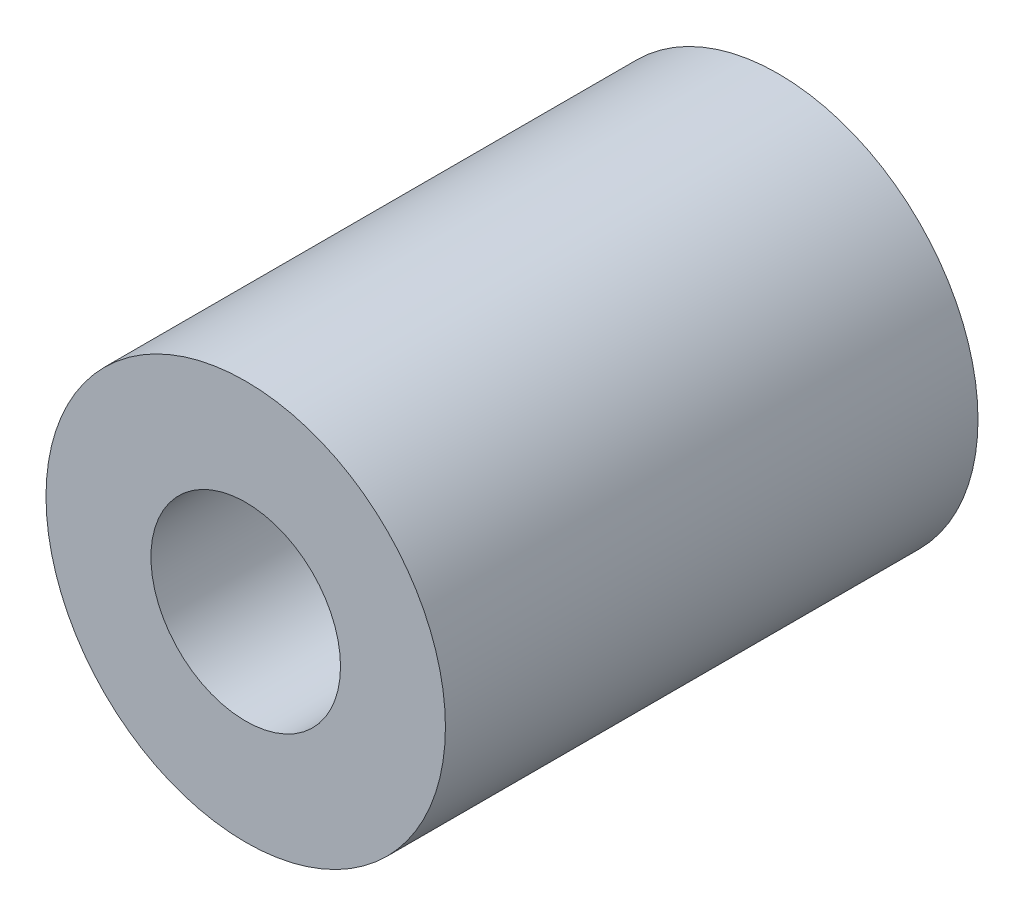
ISO-10303-21;
HEADER;
FILE_DESCRIPTION(('STEP AP214'),'2;1');
FILE_NAME('part.step','',(''),(''),'','','');
FILE_SCHEMA(('AUTOMOTIVE_DESIGN { 1 0 10303 214 1 1 1 1 }'));
ENDSEC;
DATA;
#1=APPLICATION_CONTEXT('core data for automotive mechanical design processes');
#2=APPLICATION_PROTOCOL_DEFINITION('international standard','automotive_design',2000,#1);
#3=PRODUCT_CONTEXT('',#1,'mechanical');
#4=PRODUCT('Part','Part','',(#3));
#5=PRODUCT_RELATED_PRODUCT_CATEGORY('part','',(#4));
#6=PRODUCT_DEFINITION_FORMATION('','',#4);
#7=PRODUCT_DEFINITION_CONTEXT('part definition',#1,'design');
#8=PRODUCT_DEFINITION('design','',#6,#7);
#9=PRODUCT_DEFINITION_SHAPE('','',#8);
#10=(LENGTH_UNIT() NAMED_UNIT(*) SI_UNIT(.MILLI.,.METRE.));
#11=(NAMED_UNIT(*) PLANE_ANGLE_UNIT() SI_UNIT($,.RADIAN.));
#12=(NAMED_UNIT(*) SI_UNIT($,.STERADIAN.) SOLID_ANGLE_UNIT());
#13=UNCERTAINTY_MEASURE_WITH_UNIT(LENGTH_MEASURE(1.E-05),#10,'distance_accuracy_value','');
#14=(GEOMETRIC_REPRESENTATION_CONTEXT(3) GLOBAL_UNCERTAINTY_ASSIGNED_CONTEXT((#13)) GLOBAL_UNIT_ASSIGNED_CONTEXT((#10,
#11,#12)) REPRESENTATION_CONTEXT('',''));
#15=CARTESIAN_POINT('',(0.,0.,0.));
#16=DIRECTION('',(0.,0.,1.));
#17=DIRECTION('',(1.,0.,0.));
#18=AXIS2_PLACEMENT_3D('',#15,#16,#17);
#19=CARTESIAN_POINT('',(0.,0.,6.35));
#20=DIRECTION('',(0.,0.,-1.));
#21=DIRECTION('',(-1.,0.,0.));
#22=AXIS2_PLACEMENT_3D('',#19,#20,#21);
#23=CYLINDRICAL_SURFACE('',#22,2.38125);
#24=CARTESIAN_POINT('',(0.,0.,6.35));
#25=DIRECTION('',(0.,0.,1.));
#26=DIRECTION('',(1.,0.,0.));
#27=AXIS2_PLACEMENT_3D('',#24,#25,#26);
#28=CIRCLE('',#27,2.38125);
#29=CARTESIAN_POINT('',(2.38125,0.,6.35));
#30=VERTEX_POINT('',#29);
#31=EDGE_CURVE('E10',#30,#30,#28,.T.);
#32=ORIENTED_EDGE('',*,*,#31,.F.);
#33=EDGE_LOOP('',(#32));
#34=FACE_BOUND('',#33,.T.);
#35=CARTESIAN_POINT('',(0.,0.,0.));
#36=DIRECTION('',(0.,0.,1.));
#37=DIRECTION('',(1.,0.,0.));
#38=AXIS2_PLACEMENT_3D('',#35,#36,#37);
#39=CIRCLE('',#38,2.38125);
#40=CARTESIAN_POINT('',(2.38125,0.,0.));
#41=VERTEX_POINT('',#40);
#42=EDGE_CURVE('E36',#41,#41,#39,.T.);
#43=ORIENTED_EDGE('',*,*,#42,.T.);
#44=EDGE_LOOP('',(#43));
#45=FACE_BOUND('',#44,.T.);
#46=ADVANCED_FACE('F33',(#34,#45),#23,.T.);
#47=CARTESIAN_POINT('',(0.,0.,6.35));
#48=DIRECTION('',(0.,0.,1.));
#49=DIRECTION('',(1.,0.,0.));
#50=AXIS2_PLACEMENT_3D('',#47,#48,#49);
#51=PLANE('',#50);
#52=CARTESIAN_POINT('',(0.,0.,6.35));
#53=DIRECTION('',(0.,0.,1.));
#54=DIRECTION('',(1.,0.,0.));
#55=AXIS2_PLACEMENT_3D('',#52,#53,#54);
#56=CIRCLE('',#55,1.13029999999999);
#57=CARTESIAN_POINT('',(1.13029999999999,0.,6.35));
#58=VERTEX_POINT('',#57);
#59=EDGE_CURVE('E47',#58,#58,#56,.T.);
#60=ORIENTED_EDGE('',*,*,#59,.F.);
#61=EDGE_LOOP('',(#60));
#62=FACE_BOUND('',#61,.T.);
#63=ORIENTED_EDGE('',*,*,#31,.T.);
#64=EDGE_LOOP('',(#63));
#65=FACE_BOUND('',#64,.T.);
#66=ADVANCED_FACE('F53',(#62,#65),#51,.T.);
#67=CARTESIAN_POINT('',(0.,0.,0.));
#68=DIRECTION('',(0.,0.,1.));
#69=DIRECTION('',(1.,0.,0.));
#70=AXIS2_PLACEMENT_3D('',#67,#68,#69);
#71=PLANE('',#70);
#72=CARTESIAN_POINT('',(0.,0.,0.));
#73=DIRECTION('',(0.,0.,1.));
#74=DIRECTION('',(1.,0.,0.));
#75=AXIS2_PLACEMENT_3D('',#72,#73,#74);
#76=CIRCLE('',#75,1.1303);
#77=CARTESIAN_POINT('',(1.1303,0.,0.));
#78=VERTEX_POINT('',#77);
#79=EDGE_CURVE('E43',#78,#78,#76,.T.);
#80=ORIENTED_EDGE('',*,*,#79,.T.);
#81=EDGE_LOOP('',(#80));
#82=FACE_BOUND('',#81,.T.);
#83=ORIENTED_EDGE('',*,*,#42,.F.);
#84=EDGE_LOOP('',(#83));
#85=FACE_BOUND('',#84,.T.);
#86=ADVANCED_FACE('F55',(#82,#85),#71,.F.);
#87=CARTESIAN_POINT('',(0.,0.,6.35));
#88=DIRECTION('',(0.,0.,1.));
#89=DIRECTION('',(1.,0.,0.));
#90=AXIS2_PLACEMENT_3D('',#87,#88,#89);
#91=CYLINDRICAL_SURFACE('',#90,1.13029999999999);
#92=ORIENTED_EDGE('',*,*,#79,.F.);
#93=EDGE_LOOP('',(#92));
#94=FACE_BOUND('',#93,.T.);
#95=ORIENTED_EDGE('',*,*,#59,.T.);
#96=EDGE_LOOP('',(#95));
#97=FACE_BOUND('',#96,.T.);
#98=ADVANCED_FACE('F51',(#94,#97),#91,.F.);
#99=CLOSED_SHELL('',(#46,#66,#86,#98));
#100=MANIFOLD_SOLID_BREP('B2',#99);
#101=ADVANCED_BREP_SHAPE_REPRESENTATION('',(#18,#100),#14);
#102=SHAPE_DEFINITION_REPRESENTATION(#9,#101);
ENDSEC;
END-ISO-10303-21;
